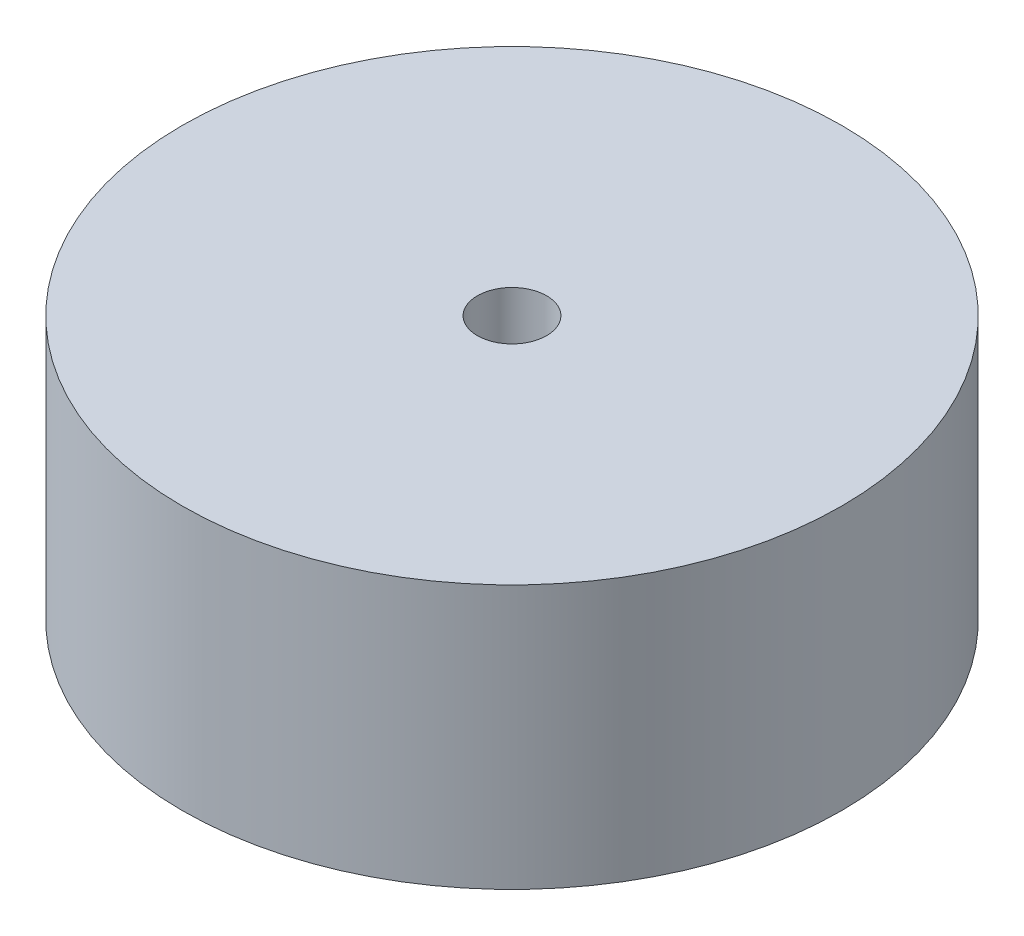
ISO-10303-21;
HEADER;
FILE_DESCRIPTION(('STEP AP214'),'2;1');
FILE_NAME('part.step','',(''),(''),'','','');
FILE_SCHEMA(('AUTOMOTIVE_DESIGN { 1 0 10303 214 1 1 1 1 }'));
ENDSEC;
DATA;
#1=APPLICATION_CONTEXT('core data for automotive mechanical design processes');
#2=APPLICATION_PROTOCOL_DEFINITION('international standard','automotive_design',2000,#1);
#3=PRODUCT_CONTEXT('',#1,'mechanical');
#4=PRODUCT('Part','Part','',(#3));
#5=PRODUCT_RELATED_PRODUCT_CATEGORY('part','',(#4));
#6=PRODUCT_DEFINITION_FORMATION('','',#4);
#7=PRODUCT_DEFINITION_CONTEXT('part definition',#1,'design');
#8=PRODUCT_DEFINITION('design','',#6,#7);
#9=PRODUCT_DEFINITION_SHAPE('','',#8);
#10=(LENGTH_UNIT() NAMED_UNIT(*) SI_UNIT(.MILLI.,.METRE.));
#11=(NAMED_UNIT(*) PLANE_ANGLE_UNIT() SI_UNIT($,.RADIAN.));
#12=(NAMED_UNIT(*) SI_UNIT($,.STERADIAN.) SOLID_ANGLE_UNIT());
#13=UNCERTAINTY_MEASURE_WITH_UNIT(LENGTH_MEASURE(1.E-05),#10,'distance_accuracy_value','');
#14=(GEOMETRIC_REPRESENTATION_CONTEXT(3) GLOBAL_UNCERTAINTY_ASSIGNED_CONTEXT((#13)) GLOBAL_UNIT_ASSIGNED_CONTEXT((#10,
#11,#12)) REPRESENTATION_CONTEXT('',''));
#15=CARTESIAN_POINT('',(0.,0.,0.));
#16=DIRECTION('',(0.,0.,1.));
#17=DIRECTION('',(1.,0.,0.));
#18=AXIS2_PLACEMENT_3D('',#15,#16,#17);
#19=CARTESIAN_POINT('',(0.,8.,0.));
#20=DIRECTION('',(0.,1.,0.));
#21=DIRECTION('',(0.,0.,1.));
#22=AXIS2_PLACEMENT_3D('',#19,#20,#21);
#23=PLANE('',#22);
#24=CARTESIAN_POINT('',(0.,8.,0.));
#25=DIRECTION('',(0.,1.,0.));
#26=DIRECTION('',(0.,0.,1.));
#27=AXIS2_PLACEMENT_3D('',#24,#25,#26);
#28=CIRCLE('',#27,10.);
#29=CARTESIAN_POINT('',(0.,8.,10.));
#30=VERTEX_POINT('',#29);
#31=EDGE_CURVE('E10',#30,#30,#28,.T.);
#32=ORIENTED_EDGE('',*,*,#31,.T.);
#33=EDGE_LOOP('',(#32));
#34=FACE_BOUND('',#33,.T.);
#35=CARTESIAN_POINT('',(0.,8.,0.));
#36=DIRECTION('',(0.,1.,0.));
#37=DIRECTION('',(0.,0.,1.));
#38=AXIS2_PLACEMENT_3D('',#35,#36,#37);
#39=CIRCLE('',#38,1.05);
#40=CARTESIAN_POINT('',(0.,8.,1.05));
#41=VERTEX_POINT('',#40);
#42=EDGE_CURVE('E42',#41,#41,#39,.T.);
#43=ORIENTED_EDGE('',*,*,#42,.F.);
#44=EDGE_LOOP('',(#43));
#45=FACE_BOUND('',#44,.T.);
#46=ADVANCED_FACE('F31',(#34,#45),#23,.T.);
#47=CARTESIAN_POINT('',(0.,0.,0.));
#48=DIRECTION('',(0.,1.,0.));
#49=DIRECTION('',(0.,0.,1.));
#50=AXIS2_PLACEMENT_3D('',#47,#48,#49);
#51=PLANE('',#50);
#52=CARTESIAN_POINT('',(0.,0.,0.));
#53=DIRECTION('',(0.,1.,0.));
#54=DIRECTION('',(0.,0.,1.));
#55=AXIS2_PLACEMENT_3D('',#52,#53,#54);
#56=CIRCLE('',#55,10.);
#57=CARTESIAN_POINT('',(0.,0.,10.));
#58=VERTEX_POINT('',#57);
#59=EDGE_CURVE('E35',#58,#58,#56,.T.);
#60=ORIENTED_EDGE('',*,*,#59,.F.);
#61=EDGE_LOOP('',(#60));
#62=FACE_BOUND('',#61,.T.);
#63=CARTESIAN_POINT('',(0.,0.,0.));
#64=DIRECTION('',(0.,1.,0.));
#65=DIRECTION('',(0.,0.,1.));
#66=AXIS2_PLACEMENT_3D('',#63,#64,#65);
#67=CIRCLE('',#66,1.05);
#68=CARTESIAN_POINT('',(0.,0.,1.05));
#69=VERTEX_POINT('',#68);
#70=EDGE_CURVE('E44',#69,#69,#67,.T.);
#71=ORIENTED_EDGE('',*,*,#70,.T.);
#72=EDGE_LOOP('',(#71));
#73=FACE_BOUND('',#72,.T.);
#74=ADVANCED_FACE('F54',(#62,#73),#51,.F.);
#75=CARTESIAN_POINT('',(0.,8.,0.));
#76=DIRECTION('',(0.,-1.,0.));
#77=DIRECTION('',(0.,0.,-1.));
#78=AXIS2_PLACEMENT_3D('',#75,#76,#77);
#79=CYLINDRICAL_SURFACE('',#78,10.);
#80=ORIENTED_EDGE('',*,*,#31,.F.);
#81=EDGE_LOOP('',(#80));
#82=FACE_BOUND('',#81,.T.);
#83=ORIENTED_EDGE('',*,*,#59,.T.);
#84=EDGE_LOOP('',(#83));
#85=FACE_BOUND('',#84,.T.);
#86=ADVANCED_FACE('F33',(#82,#85),#79,.T.);
#87=CARTESIAN_POINT('',(0.,8.,0.));
#88=DIRECTION('',(0.,-1.,0.));
#89=DIRECTION('',(0.,0.,-1.));
#90=AXIS2_PLACEMENT_3D('',#87,#88,#89);
#91=CYLINDRICAL_SURFACE('',#90,1.05);
#92=ORIENTED_EDGE('',*,*,#42,.T.);
#93=EDGE_LOOP('',(#92));
#94=FACE_BOUND('',#93,.T.);
#95=ORIENTED_EDGE('',*,*,#70,.F.);
#96=EDGE_LOOP('',(#95));
#97=FACE_BOUND('',#96,.T.);
#98=ADVANCED_FACE('F50',(#94,#97),#91,.F.);
#99=CLOSED_SHELL('',(#46,#74,#86,#98));
#100=MANIFOLD_SOLID_BREP('B2',#99);
#101=ADVANCED_BREP_SHAPE_REPRESENTATION('',(#18,#100),#14);
#102=SHAPE_DEFINITION_REPRESENTATION(#9,#101);
ENDSEC;
END-ISO-10303-21;
